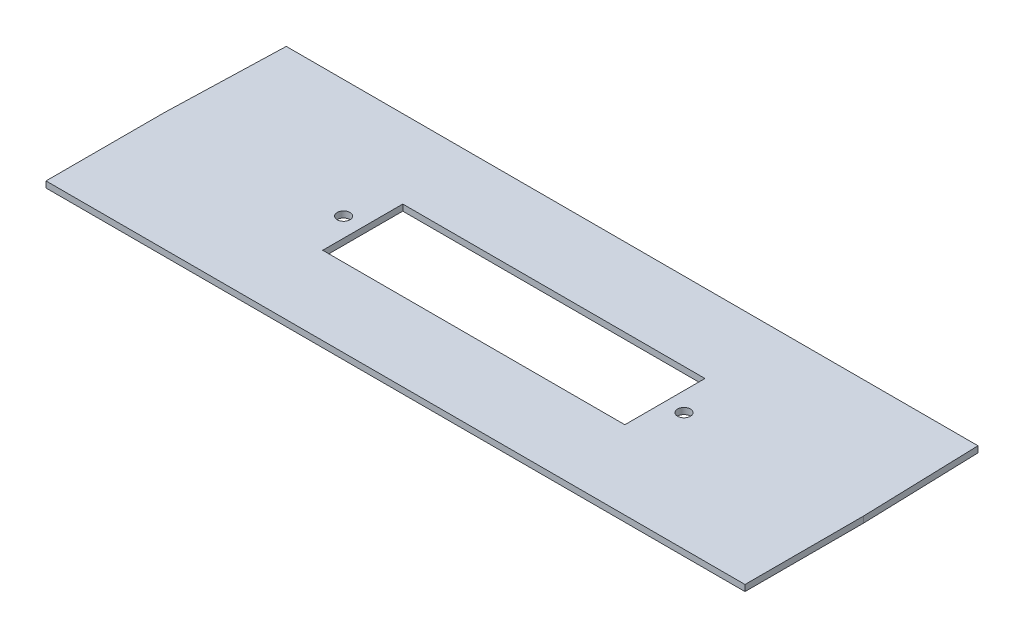
ISO-10303-21;
HEADER;
FILE_DESCRIPTION(('STEP AP214'),'2;1');
FILE_NAME('part.step','',(''),(''),'','','');
FILE_SCHEMA(('AUTOMOTIVE_DESIGN { 1 0 10303 214 1 1 1 1 }'));
ENDSEC;
DATA;
#1=APPLICATION_CONTEXT('core data for automotive mechanical design processes');
#2=APPLICATION_PROTOCOL_DEFINITION('international standard','automotive_design',2000,#1);
#3=PRODUCT_CONTEXT('',#1,'mechanical');
#4=PRODUCT('Part','Part','',(#3));
#5=PRODUCT_RELATED_PRODUCT_CATEGORY('part','',(#4));
#6=PRODUCT_DEFINITION_FORMATION('','',#4);
#7=PRODUCT_DEFINITION_CONTEXT('part definition',#1,'design');
#8=PRODUCT_DEFINITION('design','',#6,#7);
#9=PRODUCT_DEFINITION_SHAPE('','',#8);
#10=(LENGTH_UNIT() NAMED_UNIT(*) SI_UNIT(.MILLI.,.METRE.));
#11=(NAMED_UNIT(*) PLANE_ANGLE_UNIT() SI_UNIT($,.RADIAN.));
#12=(NAMED_UNIT(*) SI_UNIT($,.STERADIAN.) SOLID_ANGLE_UNIT());
#13=UNCERTAINTY_MEASURE_WITH_UNIT(LENGTH_MEASURE(1.E-05),#10,'distance_accuracy_value','');
#14=(GEOMETRIC_REPRESENTATION_CONTEXT(3) GLOBAL_UNCERTAINTY_ASSIGNED_CONTEXT((#13)) GLOBAL_UNIT_ASSIGNED_CONTEXT((#10,
#11,#12)) REPRESENTATION_CONTEXT('',''));
#15=CARTESIAN_POINT('',(0.,0.,0.));
#16=DIRECTION('',(0.,0.,1.));
#17=DIRECTION('',(1.,0.,0.));
#18=AXIS2_PLACEMENT_3D('',#15,#16,#17);
#19=CARTESIAN_POINT('',(96.,1.7,0.));
#20=DIRECTION('',(-1.,0.,0.));
#21=DIRECTION('',(0.,0.,1.));
#22=AXIS2_PLACEMENT_3D('',#19,#20,#21);
#23=PLANE('',#22);
#24=DIRECTION('',(0.,0.,-1.));
#25=VECTOR('',#24,1.);
#26=CARTESIAN_POINT('',(96.,0.,0.));
#27=LINE('',#26,#25);
#28=CARTESIAN_POINT('',(96.,0.,32.5));
#29=VERTEX_POINT('',#28);
#30=CARTESIAN_POINT('',(96.,0.,0.));
#31=VERTEX_POINT('',#30);
#32=EDGE_CURVE('E163',#29,#31,#27,.T.);
#33=ORIENTED_EDGE('',*,*,#32,.T.);
#34=DIRECTION('',(0.,-1.,0.));
#35=VECTOR('',#34,1.);
#36=CARTESIAN_POINT('',(96.,1.7,0.));
#37=LINE('',#36,#35);
#38=CARTESIAN_POINT('',(96.,1.7,0.));
#39=VERTEX_POINT('',#38);
#40=EDGE_CURVE('E11',#39,#31,#37,.T.);
#41=ORIENTED_EDGE('',*,*,#40,.F.);
#42=DIRECTION('',(0.,0.,-1.));
#43=VECTOR('',#42,1.);
#44=CARTESIAN_POINT('',(96.,1.7,0.));
#45=LINE('',#44,#43);
#46=CARTESIAN_POINT('',(96.,1.7,32.5));
#47=VERTEX_POINT('',#46);
#48=EDGE_CURVE('E169',#47,#39,#45,.T.);
#49=ORIENTED_EDGE('',*,*,#48,.F.);
#50=DIRECTION('',(0.,-1.,0.));
#51=VECTOR('',#50,1.);
#52=CARTESIAN_POINT('',(96.,1.7,32.5));
#53=LINE('',#52,#51);
#54=EDGE_CURVE('E189',#47,#29,#53,.T.);
#55=ORIENTED_EDGE('',*,*,#54,.T.);
#56=EDGE_LOOP('',(#33,#41,#49,#55));
#57=FACE_BOUND('',#56,.T.);
#58=ADVANCED_FACE('F39',(#57),#23,.F.);
#59=CARTESIAN_POINT('',(96.,1.7,0.));
#60=DIRECTION('',(-0.999526963076654,0.,0.030754675786974));
#61=DIRECTION('',(0.030754675786974,0.,0.999526963076654));
#62=AXIS2_PLACEMENT_3D('',#59,#60,#61);
#63=PLANE('',#62);
#64=DIRECTION('',(-0.030754675786974,0.,-0.999526963076654));
#65=VECTOR('',#64,1.);
#66=CARTESIAN_POINT('',(96.,0.,0.));
#67=LINE('',#66,#65);
#68=CARTESIAN_POINT('',(95.,0.,-32.5));
#69=VERTEX_POINT('',#68);
#70=EDGE_CURVE('E193',#31,#69,#67,.T.);
#71=ORIENTED_EDGE('',*,*,#70,.T.);
#72=DIRECTION('',(0.,-1.,0.));
#73=VECTOR('',#72,1.);
#74=CARTESIAN_POINT('',(95.,1.7,-32.5));
#75=LINE('',#74,#73);
#76=CARTESIAN_POINT('',(95.,1.7,-32.5));
#77=VERTEX_POINT('',#76);
#78=EDGE_CURVE('E47',#77,#69,#75,.T.);
#79=ORIENTED_EDGE('',*,*,#78,.F.);
#80=DIRECTION('',(-0.030754675786974,0.,-0.999526963076654));
#81=VECTOR('',#80,1.);
#82=CARTESIAN_POINT('',(96.,1.7,0.));
#83=LINE('',#82,#81);
#84=EDGE_CURVE('E173',#39,#77,#83,.T.);
#85=ORIENTED_EDGE('',*,*,#84,.F.);
#86=ORIENTED_EDGE('',*,*,#40,.T.);
#87=EDGE_LOOP('',(#71,#79,#85,#86));
#88=FACE_BOUND('',#87,.T.);
#89=ADVANCED_FACE('F248',(#88),#63,.F.);
#90=CARTESIAN_POINT('',(-95.,1.7,-32.5));
#91=DIRECTION('',(0.,0.,1.));
#92=DIRECTION('',(1.,0.,0.));
#93=AXIS2_PLACEMENT_3D('',#90,#91,#92);
#94=PLANE('',#93);
#95=DIRECTION('',(-1.,0.,0.));
#96=VECTOR('',#95,1.);
#97=CARTESIAN_POINT('',(-95.,0.,-32.5));
#98=LINE('',#97,#96);
#99=CARTESIAN_POINT('',(-95.,0.,-32.5));
#100=VERTEX_POINT('',#99);
#101=EDGE_CURVE('E196',#69,#100,#98,.T.);
#102=ORIENTED_EDGE('',*,*,#101,.T.);
#103=DIRECTION('',(0.,-1.,0.));
#104=VECTOR('',#103,1.);
#105=CARTESIAN_POINT('',(-95.,1.7,-32.5));
#106=LINE('',#105,#104);
#107=CARTESIAN_POINT('',(-95.,1.7,-32.5));
#108=VERTEX_POINT('',#107);
#109=EDGE_CURVE('E218',#108,#100,#106,.T.);
#110=ORIENTED_EDGE('',*,*,#109,.F.);
#111=DIRECTION('',(-1.,0.,0.));
#112=VECTOR('',#111,1.);
#113=CARTESIAN_POINT('',(-95.,1.7,-32.5));
#114=LINE('',#113,#112);
#115=EDGE_CURVE('E177',#77,#108,#114,.T.);
#116=ORIENTED_EDGE('',*,*,#115,.F.);
#117=ORIENTED_EDGE('',*,*,#78,.T.);
#118=EDGE_LOOP('',(#102,#110,#116,#117));
#119=FACE_BOUND('',#118,.T.);
#120=ADVANCED_FACE('F227',(#119),#94,.F.);
#121=CARTESIAN_POINT('',(-96.,1.7,0.));
#122=DIRECTION('',(0.999526963076654,0.,0.030754675786974));
#123=DIRECTION('',(0.030754675786974,0.,-0.999526963076654));
#124=AXIS2_PLACEMENT_3D('',#121,#122,#123);
#125=PLANE('',#124);
#126=DIRECTION('',(-0.030754675786974,0.,0.999526963076654));
#127=VECTOR('',#126,1.);
#128=CARTESIAN_POINT('',(-96.,0.,0.));
#129=LINE('',#128,#127);
#130=CARTESIAN_POINT('',(-96.,0.,0.));
#131=VERTEX_POINT('',#130);
#132=EDGE_CURVE('E199',#100,#131,#129,.T.);
#133=ORIENTED_EDGE('',*,*,#132,.T.);
#134=DIRECTION('',(0.,-1.,0.));
#135=VECTOR('',#134,1.);
#136=CARTESIAN_POINT('',(-96.,1.7,0.));
#137=LINE('',#136,#135);
#138=CARTESIAN_POINT('',(-96.,1.7,0.));
#139=VERTEX_POINT('',#138);
#140=EDGE_CURVE('E214',#139,#131,#137,.T.);
#141=ORIENTED_EDGE('',*,*,#140,.F.);
#142=DIRECTION('',(-0.030754675786974,0.,0.999526963076654));
#143=VECTOR('',#142,1.);
#144=CARTESIAN_POINT('',(-96.,1.7,0.));
#145=LINE('',#144,#143);
#146=EDGE_CURVE('E180',#108,#139,#145,.T.);
#147=ORIENTED_EDGE('',*,*,#146,.F.);
#148=ORIENTED_EDGE('',*,*,#109,.T.);
#149=EDGE_LOOP('',(#133,#141,#147,#148));
#150=FACE_BOUND('',#149,.T.);
#151=ADVANCED_FACE('F236',(#150),#125,.F.);
#152=CARTESIAN_POINT('',(-96.,1.7,0.));
#153=DIRECTION('',(1.,0.,0.));
#154=DIRECTION('',(0.,0.,-1.));
#155=AXIS2_PLACEMENT_3D('',#152,#153,#154);
#156=PLANE('',#155);
#157=DIRECTION('',(0.,0.,1.));
#158=VECTOR('',#157,1.);
#159=CARTESIAN_POINT('',(-96.,0.,0.));
#160=LINE('',#159,#158);
#161=CARTESIAN_POINT('',(-96.,0.,32.5));
#162=VERTEX_POINT('',#161);
#163=EDGE_CURVE('E202',#131,#162,#160,.T.);
#164=ORIENTED_EDGE('',*,*,#163,.T.);
#165=DIRECTION('',(0.,-1.,0.));
#166=VECTOR('',#165,1.);
#167=CARTESIAN_POINT('',(-96.,1.7,32.5));
#168=LINE('',#167,#166);
#169=CARTESIAN_POINT('',(-96.,1.7,32.5));
#170=VERTEX_POINT('',#169);
#171=EDGE_CURVE('E210',#170,#162,#168,.T.);
#172=ORIENTED_EDGE('',*,*,#171,.F.);
#173=DIRECTION('',(0.,0.,1.));
#174=VECTOR('',#173,1.);
#175=CARTESIAN_POINT('',(-96.,1.7,0.));
#176=LINE('',#175,#174);
#177=EDGE_CURVE('E183',#139,#170,#176,.T.);
#178=ORIENTED_EDGE('',*,*,#177,.F.);
#179=ORIENTED_EDGE('',*,*,#140,.T.);
#180=EDGE_LOOP('',(#164,#172,#178,#179));
#181=FACE_BOUND('',#180,.T.);
#182=ADVANCED_FACE('F240',(#181),#156,.F.);
#183=CARTESIAN_POINT('',(-96.,1.7,32.5));
#184=DIRECTION('',(0.,0.,-1.));
#185=DIRECTION('',(-1.,0.,0.));
#186=AXIS2_PLACEMENT_3D('',#183,#184,#185);
#187=PLANE('',#186);
#188=DIRECTION('',(1.,0.,0.));
#189=VECTOR('',#188,1.);
#190=CARTESIAN_POINT('',(-96.,0.,32.5));
#191=LINE('',#190,#189);
#192=EDGE_CURVE('E174',#162,#29,#191,.T.);
#193=ORIENTED_EDGE('',*,*,#192,.T.);
#194=ORIENTED_EDGE('',*,*,#54,.F.);
#195=DIRECTION('',(1.,0.,0.));
#196=VECTOR('',#195,1.);
#197=CARTESIAN_POINT('',(-96.,1.7,32.5));
#198=LINE('',#197,#196);
#199=EDGE_CURVE('E186',#170,#47,#198,.T.);
#200=ORIENTED_EDGE('',*,*,#199,.F.);
#201=ORIENTED_EDGE('',*,*,#171,.T.);
#202=EDGE_LOOP('',(#193,#194,#200,#201));
#203=FACE_BOUND('',#202,.T.);
#204=ADVANCED_FACE('F251',(#203),#187,.F.);
#205=CARTESIAN_POINT('',(0.,1.7,0.));
#206=DIRECTION('',(0.,1.,0.));
#207=DIRECTION('',(0.,0.,1.));
#208=AXIS2_PLACEMENT_3D('',#205,#206,#207);
#209=PLANE('',#208);
#210=CARTESIAN_POINT('',(-46.75,1.7,0.));
#211=DIRECTION('',(0.,1.,0.));
#212=DIRECTION('',(0.,0.,1.));
#213=AXIS2_PLACEMENT_3D('',#210,#211,#212);
#214=CIRCLE('',#213,1.75);
#215=CARTESIAN_POINT('',(-46.75,1.7,1.75));
#216=VERTEX_POINT('',#215);
#217=EDGE_CURVE('E144',#216,#216,#214,.T.);
#218=ORIENTED_EDGE('',*,*,#217,.F.);
#219=EDGE_LOOP('',(#218));
#220=FACE_BOUND('',#219,.T.);
#221=CARTESIAN_POINT('',(46.75,1.7,0.));
#222=DIRECTION('',(0.,1.,0.));
#223=DIRECTION('',(0.,0.,1.));
#224=AXIS2_PLACEMENT_3D('',#221,#222,#223);
#225=CIRCLE('',#224,1.75);
#226=CARTESIAN_POINT('',(46.75,1.7,1.75));
#227=VERTEX_POINT('',#226);
#228=EDGE_CURVE('E365',#227,#227,#225,.T.);
#229=ORIENTED_EDGE('',*,*,#228,.F.);
#230=EDGE_LOOP('',(#229));
#231=FACE_BOUND('',#230,.T.);
#232=DIRECTION('',(0.,0.,-1.));
#233=VECTOR('',#232,1.);
#234=CARTESIAN_POINT('',(41.5,1.7,-11.));
#235=LINE('',#234,#233);
#236=CARTESIAN_POINT('',(41.5,1.7,11.));
#237=VERTEX_POINT('',#236);
#238=CARTESIAN_POINT('',(41.5,1.7,-11.));
#239=VERTEX_POINT('',#238);
#240=EDGE_CURVE('E54',#237,#239,#235,.T.);
#241=ORIENTED_EDGE('',*,*,#240,.F.);
#242=DIRECTION('',(1.,0.,0.));
#243=VECTOR('',#242,1.);
#244=CARTESIAN_POINT('',(-41.5,1.7,11.));
#245=LINE('',#244,#243);
#246=CARTESIAN_POINT('',(-41.5,1.7,11.));
#247=VERTEX_POINT('',#246);
#248=EDGE_CURVE('E137',#247,#237,#245,.T.);
#249=ORIENTED_EDGE('',*,*,#248,.F.);
#250=DIRECTION('',(0.,0.,1.));
#251=VECTOR('',#250,1.);
#252=CARTESIAN_POINT('',(-41.5,1.7,-11.));
#253=LINE('',#252,#251);
#254=CARTESIAN_POINT('',(-41.5,1.7,-11.));
#255=VERTEX_POINT('',#254);
#256=EDGE_CURVE('E141',#255,#247,#253,.T.);
#257=ORIENTED_EDGE('',*,*,#256,.F.);
#258=DIRECTION('',(-1.,0.,0.));
#259=VECTOR('',#258,1.);
#260=CARTESIAN_POINT('',(-41.5,1.7,-11.));
#261=LINE('',#260,#259);
#262=EDGE_CURVE('E153',#239,#255,#261,.T.);
#263=ORIENTED_EDGE('',*,*,#262,.F.);
#264=EDGE_LOOP('',(#241,#249,#257,#263));
#265=FACE_BOUND('',#264,.T.);
#266=ORIENTED_EDGE('',*,*,#48,.T.);
#267=ORIENTED_EDGE('',*,*,#84,.T.);
#268=ORIENTED_EDGE('',*,*,#115,.T.);
#269=ORIENTED_EDGE('',*,*,#146,.T.);
#270=ORIENTED_EDGE('',*,*,#177,.T.);
#271=ORIENTED_EDGE('',*,*,#199,.T.);
#272=EDGE_LOOP('',(#266,#267,#268,#269,#270,#271));
#273=FACE_BOUND('',#272,.T.);
#274=ADVANCED_FACE('F244',(#220,#231,#265,#273),#209,.T.);
#275=CARTESIAN_POINT('',(0.,0.,0.));
#276=DIRECTION('',(0.,1.,0.));
#277=DIRECTION('',(0.,0.,1.));
#278=AXIS2_PLACEMENT_3D('',#275,#276,#277);
#279=PLANE('',#278);
#280=CARTESIAN_POINT('',(-46.75,0.,0.));
#281=DIRECTION('',(0.,1.,0.));
#282=DIRECTION('',(0.,0.,1.));
#283=AXIS2_PLACEMENT_3D('',#280,#281,#282);
#284=CIRCLE('',#283,1.75);
#285=CARTESIAN_POINT('',(-46.75,0.,1.75));
#286=VERTEX_POINT('',#285);
#287=EDGE_CURVE('E360',#286,#286,#284,.T.);
#288=ORIENTED_EDGE('',*,*,#287,.T.);
#289=EDGE_LOOP('',(#288));
#290=FACE_BOUND('',#289,.T.);
#291=CARTESIAN_POINT('',(46.75,0.,0.));
#292=DIRECTION('',(0.,1.,0.));
#293=DIRECTION('',(0.,0.,1.));
#294=AXIS2_PLACEMENT_3D('',#291,#292,#293);
#295=CIRCLE('',#294,1.75);
#296=CARTESIAN_POINT('',(46.75,0.,1.75));
#297=VERTEX_POINT('',#296);
#298=EDGE_CURVE('E154',#297,#297,#295,.T.);
#299=ORIENTED_EDGE('',*,*,#298,.T.);
#300=EDGE_LOOP('',(#299));
#301=FACE_BOUND('',#300,.T.);
#302=DIRECTION('',(1.,0.,0.));
#303=VECTOR('',#302,1.);
#304=CARTESIAN_POINT('',(-41.5,0.,11.));
#305=LINE('',#304,#303);
#306=CARTESIAN_POINT('',(-41.5,0.,11.));
#307=VERTEX_POINT('',#306);
#308=CARTESIAN_POINT('',(41.5,0.,11.));
#309=VERTEX_POINT('',#308);
#310=EDGE_CURVE('E125',#307,#309,#305,.T.);
#311=ORIENTED_EDGE('',*,*,#310,.T.);
#312=DIRECTION('',(0.,0.,-1.));
#313=VECTOR('',#312,1.);
#314=CARTESIAN_POINT('',(41.5,0.,-11.));
#315=LINE('',#314,#313);
#316=CARTESIAN_POINT('',(41.5,0.,-11.));
#317=VERTEX_POINT('',#316);
#318=EDGE_CURVE('E118',#309,#317,#315,.T.);
#319=ORIENTED_EDGE('',*,*,#318,.T.);
#320=DIRECTION('',(-1.,0.,0.));
#321=VECTOR('',#320,1.);
#322=CARTESIAN_POINT('',(-41.5,0.,-11.));
#323=LINE('',#322,#321);
#324=CARTESIAN_POINT('',(-41.5,0.,-11.));
#325=VERTEX_POINT('',#324);
#326=EDGE_CURVE('E128',#317,#325,#323,.T.);
#327=ORIENTED_EDGE('',*,*,#326,.T.);
#328=DIRECTION('',(0.,0.,1.));
#329=VECTOR('',#328,1.);
#330=CARTESIAN_POINT('',(-41.5,0.,-11.));
#331=LINE('',#330,#329);
#332=EDGE_CURVE('E62',#325,#307,#331,.T.);
#333=ORIENTED_EDGE('',*,*,#332,.T.);
#334=EDGE_LOOP('',(#311,#319,#327,#333));
#335=FACE_BOUND('',#334,.T.);
#336=ORIENTED_EDGE('',*,*,#32,.F.);
#337=ORIENTED_EDGE('',*,*,#192,.F.);
#338=ORIENTED_EDGE('',*,*,#163,.F.);
#339=ORIENTED_EDGE('',*,*,#132,.F.);
#340=ORIENTED_EDGE('',*,*,#101,.F.);
#341=ORIENTED_EDGE('',*,*,#70,.F.);
#342=EDGE_LOOP('',(#336,#337,#338,#339,#340,#341));
#343=FACE_BOUND('',#342,.T.);
#344=ADVANCED_FACE('F133',(#290,#301,#335,#343),#279,.F.);
#345=CARTESIAN_POINT('',(41.5,0.,-11.));
#346=DIRECTION('',(1.,0.,0.));
#347=DIRECTION('',(0.,0.,-1.));
#348=AXIS2_PLACEMENT_3D('',#345,#346,#347);
#349=PLANE('',#348);
#350=ORIENTED_EDGE('',*,*,#240,.T.);
#351=DIRECTION('',(0.,1.,0.));
#352=VECTOR('',#351,1.);
#353=CARTESIAN_POINT('',(41.5,0.,-11.));
#354=LINE('',#353,#352);
#355=EDGE_CURVE('E114',#317,#239,#354,.T.);
#356=ORIENTED_EDGE('',*,*,#355,.F.);
#357=ORIENTED_EDGE('',*,*,#318,.F.);
#358=DIRECTION('',(0.,1.,0.));
#359=VECTOR('',#358,1.);
#360=CARTESIAN_POINT('',(41.5,0.,11.));
#361=LINE('',#360,#359);
#362=EDGE_CURVE('E160',#309,#237,#361,.T.);
#363=ORIENTED_EDGE('',*,*,#362,.T.);
#364=EDGE_LOOP('',(#350,#356,#357,#363));
#365=FACE_BOUND('',#364,.T.);
#366=ADVANCED_FACE('F116',(#365),#349,.F.);
#367=CARTESIAN_POINT('',(-41.5,0.,11.));
#368=DIRECTION('',(0.,0.,1.));
#369=DIRECTION('',(1.,0.,0.));
#370=AXIS2_PLACEMENT_3D('',#367,#368,#369);
#371=PLANE('',#370);
#372=ORIENTED_EDGE('',*,*,#248,.T.);
#373=ORIENTED_EDGE('',*,*,#362,.F.);
#374=ORIENTED_EDGE('',*,*,#310,.F.);
#375=DIRECTION('',(0.,1.,0.));
#376=VECTOR('',#375,1.);
#377=CARTESIAN_POINT('',(-41.5,0.,11.));
#378=LINE('',#377,#376);
#379=EDGE_CURVE('E164',#307,#247,#378,.T.);
#380=ORIENTED_EDGE('',*,*,#379,.T.);
#381=EDGE_LOOP('',(#372,#373,#374,#380));
#382=FACE_BOUND('',#381,.T.);
#383=ADVANCED_FACE('F307',(#382),#371,.F.);
#384=CARTESIAN_POINT('',(-41.5,0.,-11.));
#385=DIRECTION('',(-1.,0.,0.));
#386=DIRECTION('',(0.,0.,1.));
#387=AXIS2_PLACEMENT_3D('',#384,#385,#386);
#388=PLANE('',#387);
#389=ORIENTED_EDGE('',*,*,#256,.T.);
#390=ORIENTED_EDGE('',*,*,#379,.F.);
#391=ORIENTED_EDGE('',*,*,#332,.F.);
#392=DIRECTION('',(0.,1.,0.));
#393=VECTOR('',#392,1.);
#394=CARTESIAN_POINT('',(-41.5,0.,-11.));
#395=LINE('',#394,#393);
#396=EDGE_CURVE('E124',#325,#255,#395,.T.);
#397=ORIENTED_EDGE('',*,*,#396,.T.);
#398=EDGE_LOOP('',(#389,#390,#391,#397));
#399=FACE_BOUND('',#398,.T.);
#400=ADVANCED_FACE('F316',(#399),#388,.F.);
#401=CARTESIAN_POINT('',(-41.5,0.,-11.));
#402=DIRECTION('',(0.,0.,-1.));
#403=DIRECTION('',(-1.,0.,0.));
#404=AXIS2_PLACEMENT_3D('',#401,#402,#403);
#405=PLANE('',#404);
#406=ORIENTED_EDGE('',*,*,#262,.T.);
#407=ORIENTED_EDGE('',*,*,#396,.F.);
#408=ORIENTED_EDGE('',*,*,#326,.F.);
#409=ORIENTED_EDGE('',*,*,#355,.T.);
#410=EDGE_LOOP('',(#406,#407,#408,#409));
#411=FACE_BOUND('',#410,.T.);
#412=ADVANCED_FACE('F129',(#411),#405,.F.);
#413=CARTESIAN_POINT('',(46.75,0.,0.));
#414=DIRECTION('',(0.,1.,0.));
#415=DIRECTION('',(0.,0.,1.));
#416=AXIS2_PLACEMENT_3D('',#413,#414,#415);
#417=CYLINDRICAL_SURFACE('',#416,1.75);
#418=ORIENTED_EDGE('',*,*,#298,.F.);
#419=EDGE_LOOP('',(#418));
#420=FACE_BOUND('',#419,.T.);
#421=ORIENTED_EDGE('',*,*,#228,.T.);
#422=EDGE_LOOP('',(#421));
#423=FACE_BOUND('',#422,.T.);
#424=ADVANCED_FACE('F334',(#420,#423),#417,.F.);
#425=CARTESIAN_POINT('',(-46.75,0.,0.));
#426=DIRECTION('',(0.,1.,0.));
#427=DIRECTION('',(0.,0.,1.));
#428=AXIS2_PLACEMENT_3D('',#425,#426,#427);
#429=CYLINDRICAL_SURFACE('',#428,1.75);
#430=ORIENTED_EDGE('',*,*,#287,.F.);
#431=EDGE_LOOP('',(#430));
#432=FACE_BOUND('',#431,.T.);
#433=ORIENTED_EDGE('',*,*,#217,.T.);
#434=EDGE_LOOP('',(#433));
#435=FACE_BOUND('',#434,.T.);
#436=ADVANCED_FACE('F343',(#432,#435),#429,.F.);
#437=CLOSED_SHELL('',(#58,#89,#120,#151,#182,#204,#274,#344,#366,#383,#400,#412,#424,#436));
#438=MANIFOLD_SOLID_BREP('B2',#437);
#439=ADVANCED_BREP_SHAPE_REPRESENTATION('',(#18,#438),#14);
#440=SHAPE_DEFINITION_REPRESENTATION(#9,#439);
ENDSEC;
END-ISO-10303-21;
